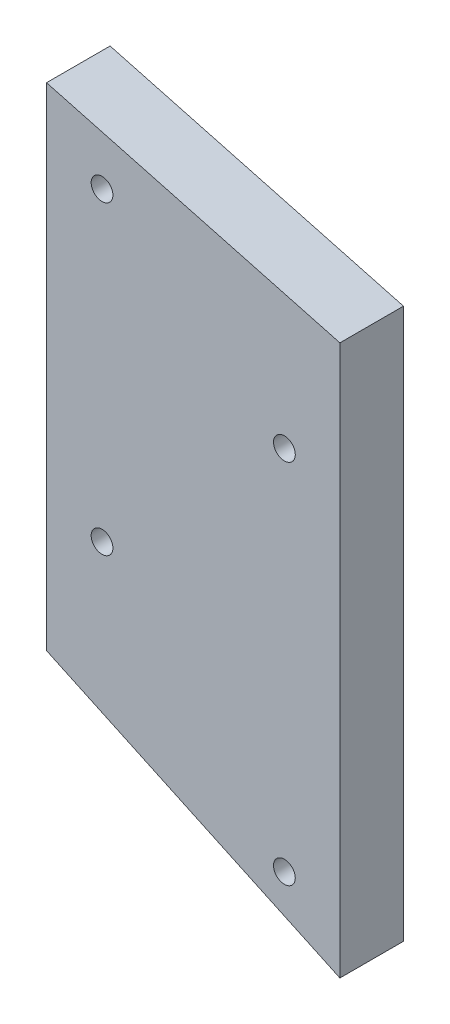
ISO-10303-21;
HEADER;
FILE_DESCRIPTION(('STEP AP214'),'2;1');
FILE_NAME('part.step','',(''),(''),'','','');
FILE_SCHEMA(('AUTOMOTIVE_DESIGN { 1 0 10303 214 1 1 1 1 }'));
ENDSEC;
DATA;
#1=APPLICATION_CONTEXT('core data for automotive mechanical design processes');
#2=APPLICATION_PROTOCOL_DEFINITION('international standard','automotive_design',2000,#1);
#3=PRODUCT_CONTEXT('',#1,'mechanical');
#4=PRODUCT('Part','Part','',(#3));
#5=PRODUCT_RELATED_PRODUCT_CATEGORY('part','',(#4));
#6=PRODUCT_DEFINITION_FORMATION('','',#4);
#7=PRODUCT_DEFINITION_CONTEXT('part definition',#1,'design');
#8=PRODUCT_DEFINITION('design','',#6,#7);
#9=PRODUCT_DEFINITION_SHAPE('','',#8);
#10=(LENGTH_UNIT() NAMED_UNIT(*) SI_UNIT(.MILLI.,.METRE.));
#11=(NAMED_UNIT(*) PLANE_ANGLE_UNIT() SI_UNIT($,.RADIAN.));
#12=(NAMED_UNIT(*) SI_UNIT($,.STERADIAN.) SOLID_ANGLE_UNIT());
#13=UNCERTAINTY_MEASURE_WITH_UNIT(LENGTH_MEASURE(1.E-05),#10,'distance_accuracy_value','');
#14=(GEOMETRIC_REPRESENTATION_CONTEXT(3) GLOBAL_UNCERTAINTY_ASSIGNED_CONTEXT((#13)) GLOBAL_UNIT_ASSIGNED_CONTEXT((#10,
#11,#12)) REPRESENTATION_CONTEXT('',''));
#15=CARTESIAN_POINT('',(0.,0.,0.));
#16=DIRECTION('',(0.,0.,1.));
#17=DIRECTION('',(1.,0.,0.));
#18=AXIS2_PLACEMENT_3D('',#15,#16,#17);
#19=CARTESIAN_POINT('',(-15.24,32.6585456926503,6.604));
#20=DIRECTION('',(-0.258819045102521,-0.965925826289068,0.));
#21=DIRECTION('',(0.965925826289068,-0.258819045102521,0.));
#22=AXIS2_PLACEMENT_3D('',#19,#20,#21);
#23=PLANE('',#22);
#24=DIRECTION('',(-0.965925826289068,0.258819045102521,0.));
#25=VECTOR('',#24,1.);
#26=CARTESIAN_POINT('',(-15.24,32.6585456926503,0.));
#27=LINE('',#26,#25);
#28=CARTESIAN_POINT('',(15.24,24.4914543073497,0.));
#29=VERTEX_POINT('',#28);
#30=CARTESIAN_POINT('',(-15.24,32.6585456926503,0.));
#31=VERTEX_POINT('',#30);
#32=EDGE_CURVE('E100',#29,#31,#27,.T.);
#33=ORIENTED_EDGE('',*,*,#32,.T.);
#34=DIRECTION('',(0.,0.,-1.));
#35=VECTOR('',#34,1.);
#36=CARTESIAN_POINT('',(-15.24,32.6585456926503,6.604));
#37=LINE('',#36,#35);
#38=CARTESIAN_POINT('',(-15.24,32.6585456926503,6.604));
#39=VERTEX_POINT('',#38);
#40=EDGE_CURVE('E11',#39,#31,#37,.T.);
#41=ORIENTED_EDGE('',*,*,#40,.F.);
#42=DIRECTION('',(-0.965925826289068,0.258819045102521,0.));
#43=VECTOR('',#42,1.);
#44=CARTESIAN_POINT('',(-15.24,32.6585456926503,6.604));
#45=LINE('',#44,#43);
#46=CARTESIAN_POINT('',(15.24,24.4914543073497,6.604));
#47=VERTEX_POINT('',#46);
#48=EDGE_CURVE('E87',#47,#39,#45,.T.);
#49=ORIENTED_EDGE('',*,*,#48,.F.);
#50=DIRECTION('',(0.,0.,-1.));
#51=VECTOR('',#50,1.);
#52=CARTESIAN_POINT('',(15.24,24.4914543073497,6.604));
#53=LINE('',#52,#51);
#54=EDGE_CURVE('E96',#47,#29,#53,.T.);
#55=ORIENTED_EDGE('',*,*,#54,.T.);
#56=EDGE_LOOP('',(#33,#41,#49,#55));
#57=FACE_BOUND('',#56,.T.);
#58=ADVANCED_FACE('F34',(#57),#23,.F.);
#59=CARTESIAN_POINT('',(-15.24,32.6585456926503,6.604));
#60=DIRECTION('',(1.,0.,0.));
#61=DIRECTION('',(0.,1.,0.));
#62=AXIS2_PLACEMENT_3D('',#59,#60,#61);
#63=PLANE('',#62);
#64=DIRECTION('',(0.,-1.,0.));
#65=VECTOR('',#64,1.);
#66=CARTESIAN_POINT('',(-15.24,32.6585456926503,0.));
#67=LINE('',#66,#65);
#68=CARTESIAN_POINT('',(-15.24,-18.4454882720859,0.));
#69=VERTEX_POINT('',#68);
#70=EDGE_CURVE('E91',#31,#69,#67,.T.);
#71=ORIENTED_EDGE('',*,*,#70,.T.);
#72=DIRECTION('',(0.,0.,-1.));
#73=VECTOR('',#72,1.);
#74=CARTESIAN_POINT('',(-15.24,-18.4454882720859,6.604));
#75=LINE('',#74,#73);
#76=CARTESIAN_POINT('',(-15.24,-18.4454882720859,6.604));
#77=VERTEX_POINT('',#76);
#78=EDGE_CURVE('E43',#77,#69,#75,.T.);
#79=ORIENTED_EDGE('',*,*,#78,.F.);
#80=DIRECTION('',(0.,-1.,0.));
#81=VECTOR('',#80,1.);
#82=CARTESIAN_POINT('',(-15.24,32.6585456926503,6.604));
#83=LINE('',#82,#81);
#84=EDGE_CURVE('E82',#39,#77,#83,.T.);
#85=ORIENTED_EDGE('',*,*,#84,.F.);
#86=ORIENTED_EDGE('',*,*,#40,.T.);
#87=EDGE_LOOP('',(#71,#79,#85,#86));
#88=FACE_BOUND('',#87,.T.);
#89=ADVANCED_FACE('F90',(#88),#63,.F.);
#90=CARTESIAN_POINT('',(15.24,-32.6585456926503,6.604));
#91=DIRECTION('',(0.4226182617407,0.906307787036649,0.));
#92=DIRECTION('',(-0.906307787036649,0.4226182617407,0.));
#93=AXIS2_PLACEMENT_3D('',#90,#91,#92);
#94=PLANE('',#93);
#95=DIRECTION('',(0.90630778703665,-0.4226182617407,0.));
#96=VECTOR('',#95,1.);
#97=CARTESIAN_POINT('',(15.24,-32.6585456926503,0.));
#98=LINE('',#97,#96);
#99=CARTESIAN_POINT('',(15.24,-32.6585456926503,0.));
#100=VERTEX_POINT('',#99);
#101=EDGE_CURVE('E69',#69,#100,#98,.T.);
#102=ORIENTED_EDGE('',*,*,#101,.T.);
#103=DIRECTION('',(0.,0.,-1.));
#104=VECTOR('',#103,1.);
#105=CARTESIAN_POINT('',(15.24,-32.6585456926503,6.604));
#106=LINE('',#105,#104);
#107=CARTESIAN_POINT('',(15.24,-32.6585456926503,6.604));
#108=VERTEX_POINT('',#107);
#109=EDGE_CURVE('E92',#108,#100,#106,.T.);
#110=ORIENTED_EDGE('',*,*,#109,.F.);
#111=DIRECTION('',(0.90630778703665,-0.4226182617407,0.));
#112=VECTOR('',#111,1.);
#113=CARTESIAN_POINT('',(15.24,-32.6585456926503,6.604));
#114=LINE('',#113,#112);
#115=EDGE_CURVE('E85',#77,#108,#114,.T.);
#116=ORIENTED_EDGE('',*,*,#115,.F.);
#117=ORIENTED_EDGE('',*,*,#78,.T.);
#118=EDGE_LOOP('',(#102,#110,#116,#117));
#119=FACE_BOUND('',#118,.T.);
#120=ADVANCED_FACE('F94',(#119),#94,.F.);
#121=CARTESIAN_POINT('',(15.24,24.4914543073497,6.604));
#122=DIRECTION('',(-1.,0.,0.));
#123=DIRECTION('',(0.,-1.,0.));
#124=AXIS2_PLACEMENT_3D('',#121,#122,#123);
#125=PLANE('',#124);
#126=DIRECTION('',(0.,1.,0.));
#127=VECTOR('',#126,1.);
#128=CARTESIAN_POINT('',(15.24,24.4914543073497,0.));
#129=LINE('',#128,#127);
#130=EDGE_CURVE('E75',#100,#29,#129,.T.);
#131=ORIENTED_EDGE('',*,*,#130,.T.);
#132=ORIENTED_EDGE('',*,*,#54,.F.);
#133=DIRECTION('',(0.,1.,0.));
#134=VECTOR('',#133,1.);
#135=CARTESIAN_POINT('',(15.24,24.4914543073497,6.604));
#136=LINE('',#135,#134);
#137=EDGE_CURVE('E52',#108,#47,#136,.T.);
#138=ORIENTED_EDGE('',*,*,#137,.F.);
#139=ORIENTED_EDGE('',*,*,#109,.T.);
#140=EDGE_LOOP('',(#131,#132,#138,#139));
#141=FACE_BOUND('',#140,.T.);
#142=ADVANCED_FACE('F143',(#141),#125,.F.);
#143=CARTESIAN_POINT('',(0.,0.,6.604));
#144=DIRECTION('',(0.,0.,-1.));
#145=DIRECTION('',(-1.,0.,0.));
#146=AXIS2_PLACEMENT_3D('',#143,#144,#145);
#147=PLANE('',#146);
#148=CARTESIAN_POINT('',(-9.47420000000001,25.9842,6.604));
#149=DIRECTION('',(0.,0.,1.));
#150=DIRECTION('',(1.,0.,0.));
#151=AXIS2_PLACEMENT_3D('',#148,#149,#150);
#152=CIRCLE('',#151,1.1303);
#153=CARTESIAN_POINT('',(-8.34390000000001,25.9842,6.604));
#154=VERTEX_POINT('',#153);
#155=EDGE_CURVE('E125',#154,#154,#152,.T.);
#156=ORIENTED_EDGE('',*,*,#155,.F.);
#157=EDGE_LOOP('',(#156));
#158=FACE_BOUND('',#157,.T.);
#159=CARTESIAN_POINT('',(9.47419999999999,12.1158,6.604));
#160=DIRECTION('',(0.,0.,1.));
#161=DIRECTION('',(1.,0.,0.));
#162=AXIS2_PLACEMENT_3D('',#159,#160,#161);
#163=CIRCLE('',#162,1.1303);
#164=CARTESIAN_POINT('',(10.6045,12.1158,6.604));
#165=VERTEX_POINT('',#164);
#166=EDGE_CURVE('E115',#165,#165,#163,.T.);
#167=ORIENTED_EDGE('',*,*,#166,.F.);
#168=EDGE_LOOP('',(#167));
#169=FACE_BOUND('',#168,.T.);
#170=CARTESIAN_POINT('',(-9.47420000000001,-5.7658,6.604));
#171=DIRECTION('',(0.,0.,1.));
#172=DIRECTION('',(1.,0.,0.));
#173=AXIS2_PLACEMENT_3D('',#170,#171,#172);
#174=CIRCLE('',#173,1.1303);
#175=CARTESIAN_POINT('',(-8.34390000000001,-5.7658,6.604));
#176=VERTEX_POINT('',#175);
#177=EDGE_CURVE('E112',#176,#176,#174,.T.);
#178=ORIENTED_EDGE('',*,*,#177,.F.);
#179=EDGE_LOOP('',(#178));
#180=FACE_BOUND('',#179,.T.);
#181=CARTESIAN_POINT('',(9.4742,-25.9842,6.604));
#182=DIRECTION('',(0.,0.,1.));
#183=DIRECTION('',(1.,0.,0.));
#184=AXIS2_PLACEMENT_3D('',#181,#182,#183);
#185=CIRCLE('',#184,1.1303);
#186=CARTESIAN_POINT('',(10.6045,-25.9842,6.604));
#187=VERTEX_POINT('',#186);
#188=EDGE_CURVE('E111',#187,#187,#185,.T.);
#189=ORIENTED_EDGE('',*,*,#188,.F.);
#190=EDGE_LOOP('',(#189));
#191=FACE_BOUND('',#190,.T.);
#192=ORIENTED_EDGE('',*,*,#48,.T.);
#193=ORIENTED_EDGE('',*,*,#84,.T.);
#194=ORIENTED_EDGE('',*,*,#115,.T.);
#195=ORIENTED_EDGE('',*,*,#137,.T.);
#196=EDGE_LOOP('',(#192,#193,#194,#195));
#197=FACE_BOUND('',#196,.T.);
#198=ADVANCED_FACE('F83',(#158,#169,#180,#191,#197),#147,.F.);
#199=CARTESIAN_POINT('',(0.,0.,0.));
#200=DIRECTION('',(0.,0.,-1.));
#201=DIRECTION('',(-1.,0.,0.));
#202=AXIS2_PLACEMENT_3D('',#199,#200,#201);
#203=PLANE('',#202);
#204=CARTESIAN_POINT('',(-9.47420000000001,25.9842,0.));
#205=DIRECTION('',(0.,0.,-1.));
#206=DIRECTION('',(-1.,0.,0.));
#207=AXIS2_PLACEMENT_3D('',#204,#205,#206);
#208=CIRCLE('',#207,1.1303);
#209=CARTESIAN_POINT('',(-10.6045,25.9842,0.));
#210=VERTEX_POINT('',#209);
#211=EDGE_CURVE('E37',#210,#210,#208,.T.);
#212=ORIENTED_EDGE('',*,*,#211,.F.);
#213=EDGE_LOOP('',(#212));
#214=FACE_BOUND('',#213,.T.);
#215=CARTESIAN_POINT('',(9.47419999999999,12.1158,0.));
#216=DIRECTION('',(0.,0.,-1.));
#217=DIRECTION('',(-1.,0.,0.));
#218=AXIS2_PLACEMENT_3D('',#215,#216,#217);
#219=CIRCLE('',#218,1.1303);
#220=CARTESIAN_POINT('',(8.3439,12.1158,0.));
#221=VERTEX_POINT('',#220);
#222=EDGE_CURVE('E113',#221,#221,#219,.T.);
#223=ORIENTED_EDGE('',*,*,#222,.F.);
#224=EDGE_LOOP('',(#223));
#225=FACE_BOUND('',#224,.T.);
#226=CARTESIAN_POINT('',(-9.47420000000001,-5.7658,0.));
#227=DIRECTION('',(0.,0.,-1.));
#228=DIRECTION('',(-1.,0.,0.));
#229=AXIS2_PLACEMENT_3D('',#226,#227,#228);
#230=CIRCLE('',#229,1.1303);
#231=CARTESIAN_POINT('',(-10.6045,-5.7658,0.));
#232=VERTEX_POINT('',#231);
#233=EDGE_CURVE('E109',#232,#232,#230,.T.);
#234=ORIENTED_EDGE('',*,*,#233,.F.);
#235=EDGE_LOOP('',(#234));
#236=FACE_BOUND('',#235,.T.);
#237=CARTESIAN_POINT('',(9.4742,-25.9842,0.));
#238=DIRECTION('',(0.,0.,-1.));
#239=DIRECTION('',(-1.,0.,0.));
#240=AXIS2_PLACEMENT_3D('',#237,#238,#239);
#241=CIRCLE('',#240,1.1303);
#242=CARTESIAN_POINT('',(8.34390000000001,-25.9842,0.));
#243=VERTEX_POINT('',#242);
#244=EDGE_CURVE('E103',#243,#243,#241,.T.);
#245=ORIENTED_EDGE('',*,*,#244,.F.);
#246=EDGE_LOOP('',(#245));
#247=FACE_BOUND('',#246,.T.);
#248=ORIENTED_EDGE('',*,*,#32,.F.);
#249=ORIENTED_EDGE('',*,*,#130,.F.);
#250=ORIENTED_EDGE('',*,*,#101,.F.);
#251=ORIENTED_EDGE('',*,*,#70,.F.);
#252=EDGE_LOOP('',(#248,#249,#250,#251));
#253=FACE_BOUND('',#252,.T.);
#254=ADVANCED_FACE('F136',(#214,#225,#236,#247,#253),#203,.T.);
#255=CARTESIAN_POINT('',(9.4742,-25.9842,6.604));
#256=DIRECTION('',(0.,0.,1.));
#257=DIRECTION('',(1.,0.,0.));
#258=AXIS2_PLACEMENT_3D('',#255,#256,#257);
#259=CYLINDRICAL_SURFACE('',#258,1.1303);
#260=ORIENTED_EDGE('',*,*,#244,.T.);
#261=EDGE_LOOP('',(#260));
#262=FACE_BOUND('',#261,.T.);
#263=ORIENTED_EDGE('',*,*,#188,.T.);
#264=EDGE_LOOP('',(#263));
#265=FACE_BOUND('',#264,.T.);
#266=ADVANCED_FACE('F133',(#262,#265),#259,.F.);
#267=CARTESIAN_POINT('',(-9.47420000000001,-5.7658,6.604));
#268=DIRECTION('',(0.,0.,1.));
#269=DIRECTION('',(1.,0.,0.));
#270=AXIS2_PLACEMENT_3D('',#267,#268,#269);
#271=CYLINDRICAL_SURFACE('',#270,1.1303);
#272=ORIENTED_EDGE('',*,*,#233,.T.);
#273=EDGE_LOOP('',(#272));
#274=FACE_BOUND('',#273,.T.);
#275=ORIENTED_EDGE('',*,*,#177,.T.);
#276=EDGE_LOOP('',(#275));
#277=FACE_BOUND('',#276,.T.);
#278=ADVANCED_FACE('F188',(#274,#277),#271,.F.);
#279=CARTESIAN_POINT('',(9.47419999999999,12.1158,6.604));
#280=DIRECTION('',(0.,0.,1.));
#281=DIRECTION('',(1.,0.,0.));
#282=AXIS2_PLACEMENT_3D('',#279,#280,#281);
#283=CYLINDRICAL_SURFACE('',#282,1.1303);
#284=ORIENTED_EDGE('',*,*,#222,.T.);
#285=EDGE_LOOP('',(#284));
#286=FACE_BOUND('',#285,.T.);
#287=ORIENTED_EDGE('',*,*,#166,.T.);
#288=EDGE_LOOP('',(#287));
#289=FACE_BOUND('',#288,.T.);
#290=ADVANCED_FACE('F197',(#286,#289),#283,.F.);
#291=CARTESIAN_POINT('',(-9.47420000000001,25.9842,6.604));
#292=DIRECTION('',(0.,0.,1.));
#293=DIRECTION('',(1.,0.,0.));
#294=AXIS2_PLACEMENT_3D('',#291,#292,#293);
#295=CYLINDRICAL_SURFACE('',#294,1.1303);
#296=ORIENTED_EDGE('',*,*,#211,.T.);
#297=EDGE_LOOP('',(#296));
#298=FACE_BOUND('',#297,.T.);
#299=ORIENTED_EDGE('',*,*,#155,.T.);
#300=EDGE_LOOP('',(#299));
#301=FACE_BOUND('',#300,.T.);
#302=ADVANCED_FACE('F207',(#298,#301),#295,.F.);
#303=CLOSED_SHELL('',(#58,#89,#120,#142,#198,#254,#266,#278,#290,#302));
#304=MANIFOLD_SOLID_BREP('B2',#303);
#305=ADVANCED_BREP_SHAPE_REPRESENTATION('',(#18,#304),#14);
#306=SHAPE_DEFINITION_REPRESENTATION(#9,#305);
ENDSEC;
END-ISO-10303-21;
